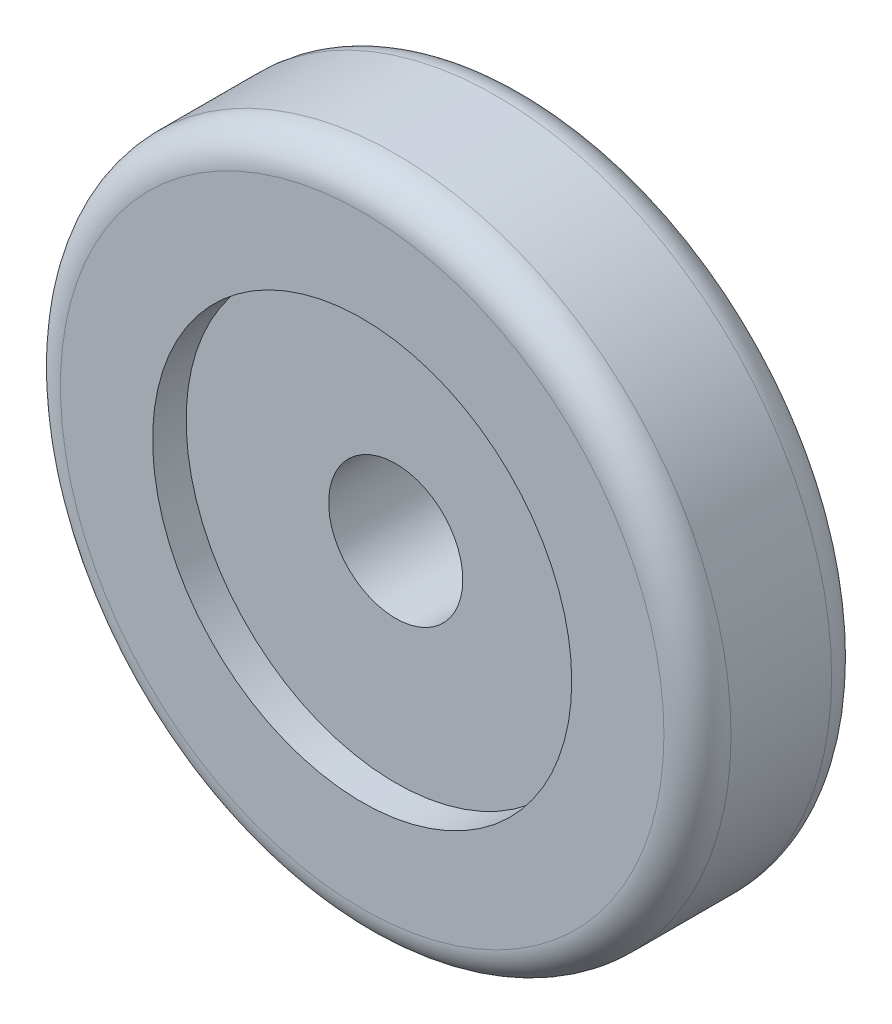
ISO-10303-21;
HEADER;
FILE_DESCRIPTION(('STEP AP214'),'2;1');
FILE_NAME('part.step','',(''),(''),'','','');
FILE_SCHEMA(('AUTOMOTIVE_DESIGN { 1 0 10303 214 1 1 1 1 }'));
ENDSEC;
DATA;
#1=APPLICATION_CONTEXT('core data for automotive mechanical design processes');
#2=APPLICATION_PROTOCOL_DEFINITION('international standard','automotive_design',2000,#1);
#3=PRODUCT_CONTEXT('',#1,'mechanical');
#4=PRODUCT('Part','Part','',(#3));
#5=PRODUCT_RELATED_PRODUCT_CATEGORY('part','',(#4));
#6=PRODUCT_DEFINITION_FORMATION('','',#4);
#7=PRODUCT_DEFINITION_CONTEXT('part definition',#1,'design');
#8=PRODUCT_DEFINITION('design','',#6,#7);
#9=PRODUCT_DEFINITION_SHAPE('','',#8);
#10=(LENGTH_UNIT() NAMED_UNIT(*) SI_UNIT(.MILLI.,.METRE.));
#11=(NAMED_UNIT(*) PLANE_ANGLE_UNIT() SI_UNIT($,.RADIAN.));
#12=(NAMED_UNIT(*) SI_UNIT($,.STERADIAN.) SOLID_ANGLE_UNIT());
#13=UNCERTAINTY_MEASURE_WITH_UNIT(LENGTH_MEASURE(1.E-05),#10,'distance_accuracy_value','');
#14=(GEOMETRIC_REPRESENTATION_CONTEXT(3) GLOBAL_UNCERTAINTY_ASSIGNED_CONTEXT((#13)) GLOBAL_UNIT_ASSIGNED_CONTEXT((#10,
#11,#12)) REPRESENTATION_CONTEXT('',''));
#15=CARTESIAN_POINT('',(0.,0.,0.));
#16=DIRECTION('',(0.,0.,1.));
#17=DIRECTION('',(1.,0.,0.));
#18=AXIS2_PLACEMENT_3D('',#15,#16,#17);
#19=CARTESIAN_POINT('',(0.,0.,10.));
#20=DIRECTION('',(0.,0.,-1.));
#21=DIRECTION('',(-1.,0.,0.));
#22=AXIS2_PLACEMENT_3D('',#19,#20,#21);
#23=CYLINDRICAL_SURFACE('',#22,4.);
#24=CARTESIAN_POINT('',(0.,0.,0.));
#25=DIRECTION('',(0.,0.,1.));
#26=DIRECTION('',(1.,0.,0.));
#27=AXIS2_PLACEMENT_3D('',#24,#25,#26);
#28=CIRCLE('',#27,4.);
#29=CARTESIAN_POINT('',(4.,0.,0.));
#30=VERTEX_POINT('',#29);
#31=EDGE_CURVE('E56',#30,#30,#28,.T.);
#32=ORIENTED_EDGE('',*,*,#31,.F.);
#33=EDGE_LOOP('',(#32));
#34=FACE_BOUND('',#33,.T.);
#35=CARTESIAN_POINT('',(0.,0.,8.));
#36=DIRECTION('',(0.,0.,1.));
#37=DIRECTION('',(1.,0.,0.));
#38=AXIS2_PLACEMENT_3D('',#35,#36,#37);
#39=CIRCLE('',#38,4.);
#40=CARTESIAN_POINT('',(4.,0.,8.));
#41=VERTEX_POINT('',#40);
#42=EDGE_CURVE('E57',#41,#41,#39,.T.);
#43=ORIENTED_EDGE('',*,*,#42,.T.);
#44=EDGE_LOOP('',(#43));
#45=FACE_BOUND('',#44,.T.);
#46=ADVANCED_FACE('F36',(#34,#45),#23,.F.);
#47=CARTESIAN_POINT('',(0.,0.,10.));
#48=DIRECTION('',(0.,0.,-1.));
#49=DIRECTION('',(-1.,0.,0.));
#50=AXIS2_PLACEMENT_3D('',#47,#48,#49);
#51=CYLINDRICAL_SURFACE('',#50,20.);
#52=CARTESIAN_POINT('',(0.,0.,2.));
#53=DIRECTION('',(0.,0.,1.));
#54=DIRECTION('',(1.,0.,0.));
#55=AXIS2_PLACEMENT_3D('',#52,#53,#54);
#56=CIRCLE('',#55,20.);
#57=CARTESIAN_POINT('',(20.,0.,2.));
#58=VERTEX_POINT('',#57);
#59=EDGE_CURVE('E47',#58,#58,#56,.T.);
#60=ORIENTED_EDGE('',*,*,#59,.T.);
#61=EDGE_LOOP('',(#60));
#62=FACE_BOUND('',#61,.T.);
#63=CARTESIAN_POINT('',(0.,0.,8.));
#64=DIRECTION('',(0.,0.,1.));
#65=DIRECTION('',(1.,0.,0.));
#66=AXIS2_PLACEMENT_3D('',#63,#64,#65);
#67=CIRCLE('',#66,20.);
#68=CARTESIAN_POINT('',(20.,0.,8.));
#69=VERTEX_POINT('',#68);
#70=EDGE_CURVE('E51',#69,#69,#67,.F.);
#71=ORIENTED_EDGE('',*,*,#70,.T.);
#72=EDGE_LOOP('',(#71));
#73=FACE_BOUND('',#72,.T.);
#74=ADVANCED_FACE('F80',(#62,#73),#51,.T.);
#75=CARTESIAN_POINT('',(0.,0.,10.));
#76=DIRECTION('',(0.,0.,1.));
#77=DIRECTION('',(1.,0.,0.));
#78=AXIS2_PLACEMENT_3D('',#75,#76,#77);
#79=PLANE('',#78);
#80=CARTESIAN_POINT('',(0.,0.,10.));
#81=DIRECTION('',(0.,0.,1.));
#82=DIRECTION('',(1.,0.,0.));
#83=AXIS2_PLACEMENT_3D('',#80,#81,#82);
#84=CIRCLE('',#83,18.);
#85=CARTESIAN_POINT('',(18.,0.,10.));
#86=VERTEX_POINT('',#85);
#87=EDGE_CURVE('E10',#86,#86,#84,.T.);
#88=ORIENTED_EDGE('',*,*,#87,.T.);
#89=EDGE_LOOP('',(#88));
#90=FACE_BOUND('',#89,.T.);
#91=CARTESIAN_POINT('',(0.,0.,10.));
#92=DIRECTION('',(0.,0.,1.));
#93=DIRECTION('',(1.,0.,0.));
#94=AXIS2_PLACEMENT_3D('',#91,#92,#93);
#95=CIRCLE('',#94,12.5);
#96=CARTESIAN_POINT('',(12.5,0.,10.));
#97=VERTEX_POINT('',#96);
#98=EDGE_CURVE('E63',#97,#97,#95,.T.);
#99=ORIENTED_EDGE('',*,*,#98,.F.);
#100=EDGE_LOOP('',(#99));
#101=FACE_BOUND('',#100,.T.);
#102=ADVANCED_FACE('F78',(#90,#101),#79,.T.);
#103=CARTESIAN_POINT('',(0.,0.,0.));
#104=DIRECTION('',(0.,0.,1.));
#105=DIRECTION('',(1.,0.,0.));
#106=AXIS2_PLACEMENT_3D('',#103,#104,#105);
#107=PLANE('',#106);
#108=CARTESIAN_POINT('',(0.,0.,0.));
#109=DIRECTION('',(0.,0.,1.));
#110=DIRECTION('',(1.,0.,0.));
#111=AXIS2_PLACEMENT_3D('',#108,#109,#110);
#112=CIRCLE('',#111,18.);
#113=CARTESIAN_POINT('',(18.,0.,0.));
#114=VERTEX_POINT('',#113);
#115=EDGE_CURVE('E43',#114,#114,#112,.F.);
#116=ORIENTED_EDGE('',*,*,#115,.T.);
#117=EDGE_LOOP('',(#116));
#118=FACE_BOUND('',#117,.T.);
#119=ORIENTED_EDGE('',*,*,#31,.T.);
#120=EDGE_LOOP('',(#119));
#121=FACE_BOUND('',#120,.T.);
#122=ADVANCED_FACE('F74',(#118,#121),#107,.F.);
#123=CARTESIAN_POINT('',(0.,0.,8.));
#124=DIRECTION('',(0.,0.,1.));
#125=DIRECTION('',(1.,0.,0.));
#126=AXIS2_PLACEMENT_3D('',#123,#124,#125);
#127=CYLINDRICAL_SURFACE('',#126,12.5);
#128=CARTESIAN_POINT('',(0.,0.,8.));
#129=DIRECTION('',(0.,0.,1.));
#130=DIRECTION('',(1.,0.,0.));
#131=AXIS2_PLACEMENT_3D('',#128,#129,#130);
#132=CIRCLE('',#131,12.5);
#133=CARTESIAN_POINT('',(12.5,0.,8.));
#134=VERTEX_POINT('',#133);
#135=EDGE_CURVE('E60',#134,#134,#132,.T.);
#136=ORIENTED_EDGE('',*,*,#135,.F.);
#137=EDGE_LOOP('',(#136));
#138=FACE_BOUND('',#137,.T.);
#139=ORIENTED_EDGE('',*,*,#98,.T.);
#140=EDGE_LOOP('',(#139));
#141=FACE_BOUND('',#140,.T.);
#142=ADVANCED_FACE('F71',(#138,#141),#127,.F.);
#143=CARTESIAN_POINT('',(0.,0.,8.));
#144=DIRECTION('',(0.,0.,1.));
#145=DIRECTION('',(1.,0.,0.));
#146=AXIS2_PLACEMENT_3D('',#143,#144,#145);
#147=PLANE('',#146);
#148=ORIENTED_EDGE('',*,*,#42,.F.);
#149=EDGE_LOOP('',(#148));
#150=FACE_BOUND('',#149,.T.);
#151=ORIENTED_EDGE('',*,*,#135,.T.);
#152=EDGE_LOOP('',(#151));
#153=FACE_BOUND('',#152,.T.);
#154=ADVANCED_FACE('F69',(#150,#153),#147,.T.);
#155=CARTESIAN_POINT('',(0.,0.,2.));
#156=DIRECTION('',(0.,0.,1.));
#157=DIRECTION('',(1.,0.,0.));
#158=AXIS2_PLACEMENT_3D('',#155,#156,#157);
#159=TOROIDAL_SURFACE('',#158,18.,2.);
#160=ORIENTED_EDGE('',*,*,#115,.F.);
#161=EDGE_LOOP('',(#160));
#162=FACE_BOUND('',#161,.T.);
#163=ORIENTED_EDGE('',*,*,#59,.F.);
#164=EDGE_LOOP('',(#163));
#165=FACE_BOUND('',#164,.T.);
#166=ADVANCED_FACE('F98',(#162,#165),#159,.T.);
#167=CARTESIAN_POINT('',(0.,0.,8.));
#168=DIRECTION('',(0.,0.,1.));
#169=DIRECTION('',(1.,0.,0.));
#170=AXIS2_PLACEMENT_3D('',#167,#168,#169);
#171=TOROIDAL_SURFACE('',#170,18.,2.);
#172=ORIENTED_EDGE('',*,*,#70,.F.);
#173=EDGE_LOOP('',(#172));
#174=FACE_BOUND('',#173,.T.);
#175=ORIENTED_EDGE('',*,*,#87,.F.);
#176=EDGE_LOOP('',(#175));
#177=FACE_BOUND('',#176,.T.);
#178=ADVANCED_FACE('F38',(#174,#177),#171,.T.);
#179=CLOSED_SHELL('',(#46,#74,#102,#122,#142,#154,#166,#178));
#180=MANIFOLD_SOLID_BREP('B2',#179);
#181=ADVANCED_BREP_SHAPE_REPRESENTATION('',(#18,#180),#14);
#182=SHAPE_DEFINITION_REPRESENTATION(#9,#181);
ENDSEC;
END-ISO-10303-21;
